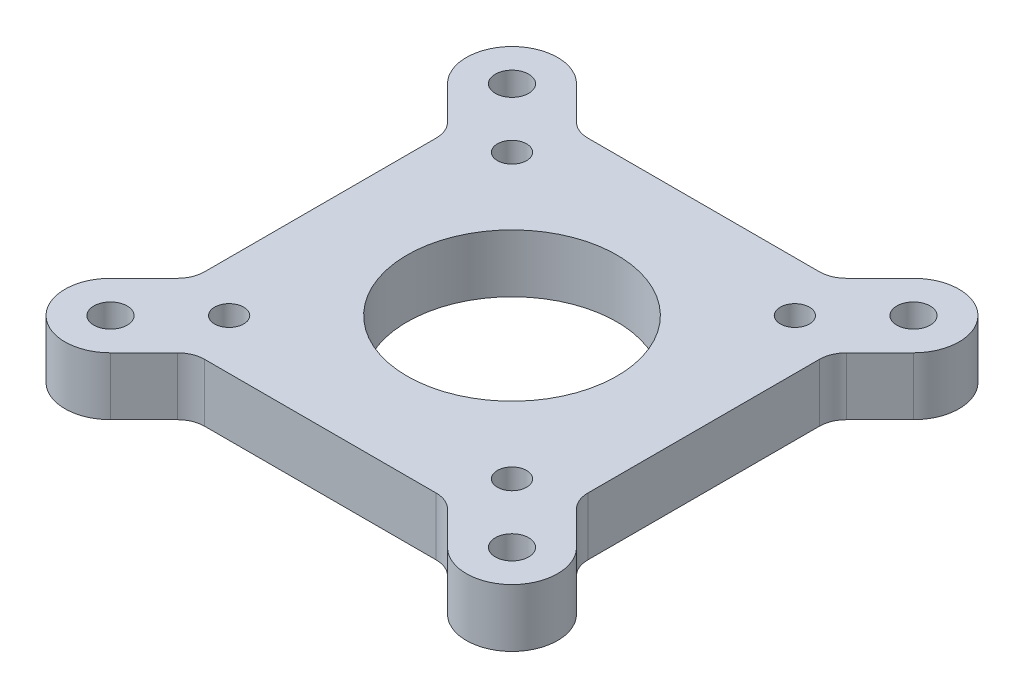
ISO-10303-21;
HEADER;
FILE_DESCRIPTION(('STEP AP214'),'2;1');
FILE_NAME('part.step','',(''),(''),'','','');
FILE_SCHEMA(('AUTOMOTIVE_DESIGN { 1 0 10303 214 1 1 1 1 }'));
ENDSEC;
DATA;
#1=APPLICATION_CONTEXT('core data for automotive mechanical design processes');
#2=APPLICATION_PROTOCOL_DEFINITION('international standard','automotive_design',2000,#1);
#3=PRODUCT_CONTEXT('',#1,'mechanical');
#4=PRODUCT('Part','Part','',(#3));
#5=PRODUCT_RELATED_PRODUCT_CATEGORY('part','',(#4));
#6=PRODUCT_DEFINITION_FORMATION('','',#4);
#7=PRODUCT_DEFINITION_CONTEXT('part definition',#1,'design');
#8=PRODUCT_DEFINITION('design','',#6,#7);
#9=PRODUCT_DEFINITION_SHAPE('','',#8);
#10=(LENGTH_UNIT() NAMED_UNIT(*) SI_UNIT(.MILLI.,.METRE.));
#11=(NAMED_UNIT(*) PLANE_ANGLE_UNIT() SI_UNIT($,.RADIAN.));
#12=(NAMED_UNIT(*) SI_UNIT($,.STERADIAN.) SOLID_ANGLE_UNIT());
#13=UNCERTAINTY_MEASURE_WITH_UNIT(LENGTH_MEASURE(1.E-05),#10,'distance_accuracy_value','');
#14=(GEOMETRIC_REPRESENTATION_CONTEXT(3) GLOBAL_UNCERTAINTY_ASSIGNED_CONTEXT((#13)) GLOBAL_UNIT_ASSIGNED_CONTEXT((#10,
#11,#12)) REPRESENTATION_CONTEXT('',''));
#15=CARTESIAN_POINT('',(0.,0.,0.));
#16=DIRECTION('',(0.,0.,1.));
#17=DIRECTION('',(1.,0.,0.));
#18=AXIS2_PLACEMENT_3D('',#15,#16,#17);
#19=CARTESIAN_POINT('',(-21.,6.35,-21.));
#20=DIRECTION('',(0.,0.,1.));
#21=DIRECTION('',(1.,0.,0.));
#22=AXIS2_PLACEMENT_3D('',#19,#20,#21);
#23=PLANE('',#22);
#24=DIRECTION('',(-1.,0.,0.));
#25=VECTOR('',#24,1.);
#26=CARTESIAN_POINT('',(-21.,6.35,-21.));
#27=LINE('',#26,#25);
#28=CARTESIAN_POINT('',(12.6862915010149,6.35,-21.));
#29=VERTEX_POINT('',#28);
#30=CARTESIAN_POINT('',(-12.6862915010152,6.35,-21.));
#31=VERTEX_POINT('',#30);
#32=EDGE_CURVE('E334',#29,#31,#27,.T.);
#33=ORIENTED_EDGE('',*,*,#32,.F.);
#34=DIRECTION('',(0.,1.,0.));
#35=VECTOR('',#34,1.);
#36=CARTESIAN_POINT('',(12.6862915010149,0.,-21.));
#37=LINE('',#36,#35);
#38=CARTESIAN_POINT('',(12.6862915010149,0.,-21.));
#39=VERTEX_POINT('',#38);
#40=EDGE_CURVE('E355',#29,#39,#37,.F.);
#41=ORIENTED_EDGE('',*,*,#40,.T.);
#42=DIRECTION('',(-1.,0.,0.));
#43=VECTOR('',#42,1.);
#44=CARTESIAN_POINT('',(-21.,0.,-21.));
#45=LINE('',#44,#43);
#46=CARTESIAN_POINT('',(-12.6862915010152,0.,-21.));
#47=VERTEX_POINT('',#46);
#48=EDGE_CURVE('E345',#39,#47,#45,.T.);
#49=ORIENTED_EDGE('',*,*,#48,.T.);
#50=DIRECTION('',(0.,1.,0.));
#51=VECTOR('',#50,1.);
#52=CARTESIAN_POINT('',(-12.6862915010152,6.35,-21.));
#53=LINE('',#52,#51);
#54=EDGE_CURVE('E352',#47,#31,#53,.T.);
#55=ORIENTED_EDGE('',*,*,#54,.T.);
#56=EDGE_LOOP('',(#33,#41,#49,#55));
#57=FACE_BOUND('',#56,.T.);
#58=ADVANCED_FACE('F34',(#57),#23,.F.);
#59=CARTESIAN_POINT('',(21.,6.35,21.));
#60=DIRECTION('',(-1.,0.,0.));
#61=DIRECTION('',(0.,0.,1.));
#62=AXIS2_PLACEMENT_3D('',#59,#60,#61);
#63=PLANE('',#62);
#64=DIRECTION('',(0.,0.,-1.));
#65=VECTOR('',#64,1.);
#66=CARTESIAN_POINT('',(21.,0.,21.));
#67=LINE('',#66,#65);
#68=CARTESIAN_POINT('',(21.,0.,12.6862915010152));
#69=VERTEX_POINT('',#68);
#70=CARTESIAN_POINT('',(21.,0.,-12.6862915010156));
#71=VERTEX_POINT('',#70);
#72=EDGE_CURVE('E342',#69,#71,#67,.T.);
#73=ORIENTED_EDGE('',*,*,#72,.T.);
#74=DIRECTION('',(0.,1.,0.));
#75=VECTOR('',#74,1.);
#76=CARTESIAN_POINT('',(21.,6.35,-12.6862915010156));
#77=LINE('',#76,#75);
#78=CARTESIAN_POINT('',(21.,6.35,-12.6862915010156));
#79=VERTEX_POINT('',#78);
#80=EDGE_CURVE('E359',#71,#79,#77,.T.);
#81=ORIENTED_EDGE('',*,*,#80,.T.);
#82=DIRECTION('',(0.,0.,-1.));
#83=VECTOR('',#82,1.);
#84=CARTESIAN_POINT('',(21.,6.35,21.));
#85=LINE('',#84,#83);
#86=CARTESIAN_POINT('',(21.,6.35,12.6862915010152));
#87=VERTEX_POINT('',#86);
#88=EDGE_CURVE('E330',#87,#79,#85,.T.);
#89=ORIENTED_EDGE('',*,*,#88,.F.);
#90=DIRECTION('',(0.,1.,0.));
#91=VECTOR('',#90,1.);
#92=CARTESIAN_POINT('',(21.,0.,12.6862915010152));
#93=LINE('',#92,#91);
#94=EDGE_CURVE('E357',#87,#69,#93,.F.);
#95=ORIENTED_EDGE('',*,*,#94,.T.);
#96=EDGE_LOOP('',(#73,#81,#89,#95));
#97=FACE_BOUND('',#96,.T.);
#98=ADVANCED_FACE('F484',(#97),#63,.F.);
#99=CARTESIAN_POINT('',(-21.,6.35,21.));
#100=DIRECTION('',(0.,0.,-1.));
#101=DIRECTION('',(-1.,0.,0.));
#102=AXIS2_PLACEMENT_3D('',#99,#100,#101);
#103=PLANE('',#102);
#104=DIRECTION('',(1.,0.,0.));
#105=VECTOR('',#104,1.);
#106=CARTESIAN_POINT('',(-21.,0.,21.));
#107=LINE('',#106,#105);
#108=CARTESIAN_POINT('',(-12.6862915010151,0.,21.));
#109=VERTEX_POINT('',#108);
#110=CARTESIAN_POINT('',(12.6862915010152,0.,21.));
#111=VERTEX_POINT('',#110);
#112=EDGE_CURVE('E326',#109,#111,#107,.T.);
#113=ORIENTED_EDGE('',*,*,#112,.T.);
#114=DIRECTION('',(0.,1.,0.));
#115=VECTOR('',#114,1.);
#116=CARTESIAN_POINT('',(12.6862915010152,6.35,21.));
#117=LINE('',#116,#115);
#118=CARTESIAN_POINT('',(12.6862915010152,6.35,21.));
#119=VERTEX_POINT('',#118);
#120=EDGE_CURVE('E368',#111,#119,#117,.T.);
#121=ORIENTED_EDGE('',*,*,#120,.T.);
#122=DIRECTION('',(1.,0.,0.));
#123=VECTOR('',#122,1.);
#124=CARTESIAN_POINT('',(-21.,6.35,21.));
#125=LINE('',#124,#123);
#126=CARTESIAN_POINT('',(-12.6862915010151,6.35,21.));
#127=VERTEX_POINT('',#126);
#128=EDGE_CURVE('E327',#127,#119,#125,.T.);
#129=ORIENTED_EDGE('',*,*,#128,.F.);
#130=DIRECTION('',(0.,1.,0.));
#131=VECTOR('',#130,1.);
#132=CARTESIAN_POINT('',(-12.6862915010151,0.,21.));
#133=LINE('',#132,#131);
#134=EDGE_CURVE('E366',#127,#109,#133,.F.);
#135=ORIENTED_EDGE('',*,*,#134,.T.);
#136=EDGE_LOOP('',(#113,#121,#129,#135));
#137=FACE_BOUND('',#136,.T.);
#138=ADVANCED_FACE('F456',(#137),#103,.F.);
#139=CARTESIAN_POINT('',(-21.,6.35,21.));
#140=DIRECTION('',(1.,0.,0.));
#141=DIRECTION('',(0.,0.,-1.));
#142=AXIS2_PLACEMENT_3D('',#139,#140,#141);
#143=PLANE('',#142);
#144=DIRECTION('',(0.,0.,1.));
#145=VECTOR('',#144,1.);
#146=CARTESIAN_POINT('',(-21.,0.,21.));
#147=LINE('',#146,#145);
#148=CARTESIAN_POINT('',(-21.,0.,-12.6862915010152));
#149=VERTEX_POINT('',#148);
#150=CARTESIAN_POINT('',(-21.,0.,12.6862915010154));
#151=VERTEX_POINT('',#150);
#152=EDGE_CURVE('E331',#149,#151,#147,.T.);
#153=ORIENTED_EDGE('',*,*,#152,.T.);
#154=DIRECTION('',(0.,1.,0.));
#155=VECTOR('',#154,1.);
#156=CARTESIAN_POINT('',(-21.,6.35,12.6862915010154));
#157=LINE('',#156,#155);
#158=CARTESIAN_POINT('',(-21.,6.35,12.6862915010154));
#159=VERTEX_POINT('',#158);
#160=EDGE_CURVE('E378',#151,#159,#157,.T.);
#161=ORIENTED_EDGE('',*,*,#160,.T.);
#162=DIRECTION('',(0.,0.,1.));
#163=VECTOR('',#162,1.);
#164=CARTESIAN_POINT('',(-21.,6.35,21.));
#165=LINE('',#164,#163);
#166=CARTESIAN_POINT('',(-21.,6.35,-12.6862915010152));
#167=VERTEX_POINT('',#166);
#168=EDGE_CURVE('E336',#167,#159,#165,.T.);
#169=ORIENTED_EDGE('',*,*,#168,.F.);
#170=DIRECTION('',(0.,1.,0.));
#171=VECTOR('',#170,1.);
#172=CARTESIAN_POINT('',(-21.,0.,-12.6862915010152));
#173=LINE('',#172,#171);
#174=EDGE_CURVE('E376',#167,#149,#173,.F.);
#175=ORIENTED_EDGE('',*,*,#174,.T.);
#176=EDGE_LOOP('',(#153,#161,#169,#175));
#177=FACE_BOUND('',#176,.T.);
#178=ADVANCED_FACE('F429',(#177),#143,.F.);
#179=CARTESIAN_POINT('',(0.,6.35,0.));
#180=DIRECTION('',(0.,1.,0.));
#181=DIRECTION('',(0.,0.,1.));
#182=AXIS2_PLACEMENT_3D('',#179,#180,#181);
#183=PLANE('',#182);
#184=CARTESIAN_POINT('',(21.9999999999998,6.35,-22.0000000000002));
#185=DIRECTION('',(0.,1.,0.));
#186=DIRECTION('',(0.,0.,1.));
#187=AXIS2_PLACEMENT_3D('',#184,#185,#186);
#188=CIRCLE('',#187,1.8288);
#189=CARTESIAN_POINT('',(21.9999999999998,6.35,-20.1712000000002));
#190=VERTEX_POINT('',#189);
#191=EDGE_CURVE('E850',#190,#190,#188,.T.);
#192=ORIENTED_EDGE('',*,*,#191,.F.);
#193=EDGE_LOOP('',(#192));
#194=FACE_BOUND('',#193,.T.);
#195=CARTESIAN_POINT('',(22.,6.35,22.));
#196=DIRECTION('',(0.,1.,0.));
#197=DIRECTION('',(0.,0.,1.));
#198=AXIS2_PLACEMENT_3D('',#195,#196,#197);
#199=CIRCLE('',#198,1.8288);
#200=CARTESIAN_POINT('',(22.,6.35,23.8288));
#201=VERTEX_POINT('',#200);
#202=EDGE_CURVE('E854',#201,#201,#199,.T.);
#203=ORIENTED_EDGE('',*,*,#202,.F.);
#204=EDGE_LOOP('',(#203));
#205=FACE_BOUND('',#204,.T.);
#206=CARTESIAN_POINT('',(-21.9999999999999,6.35,22.0000000000001));
#207=DIRECTION('',(0.,1.,0.));
#208=DIRECTION('',(0.,0.,1.));
#209=AXIS2_PLACEMENT_3D('',#206,#207,#208);
#210=CIRCLE('',#209,1.8288);
#211=CARTESIAN_POINT('',(-21.9999999999999,6.35,23.8288000000001));
#212=VERTEX_POINT('',#211);
#213=EDGE_CURVE('E857',#212,#212,#210,.T.);
#214=ORIENTED_EDGE('',*,*,#213,.F.);
#215=EDGE_LOOP('',(#214));
#216=FACE_BOUND('',#215,.T.);
#217=CARTESIAN_POINT('',(-22.,6.35,-22.));
#218=DIRECTION('',(0.,1.,0.));
#219=DIRECTION('',(0.,0.,1.));
#220=AXIS2_PLACEMENT_3D('',#217,#218,#219);
#221=CIRCLE('',#220,1.8288);
#222=CARTESIAN_POINT('',(-22.,6.35,-20.1712));
#223=VERTEX_POINT('',#222);
#224=EDGE_CURVE('E268',#223,#223,#221,.T.);
#225=ORIENTED_EDGE('',*,*,#224,.F.);
#226=EDGE_LOOP('',(#225));
#227=FACE_BOUND('',#226,.T.);
#228=CARTESIAN_POINT('',(0.,6.35,0.));
#229=DIRECTION('',(0.,1.,0.));
#230=DIRECTION('',(0.,0.,1.));
#231=AXIS2_PLACEMENT_3D('',#228,#229,#230);
#232=CIRCLE('',#231,11.5);
#233=CARTESIAN_POINT('',(0.,6.35,11.5));
#234=VERTEX_POINT('',#233);
#235=EDGE_CURVE('E294',#234,#234,#232,.T.);
#236=ORIENTED_EDGE('',*,*,#235,.F.);
#237=EDGE_LOOP('',(#236));
#238=FACE_BOUND('',#237,.T.);
#239=CARTESIAN_POINT('',(-15.5,6.35,-15.5));
#240=DIRECTION('',(0.,1.,0.));
#241=DIRECTION('',(0.,0.,1.));
#242=AXIS2_PLACEMENT_3D('',#239,#240,#241);
#243=CIRCLE('',#242,1.59999999999999);
#244=CARTESIAN_POINT('',(-15.5,6.35,-13.9));
#245=VERTEX_POINT('',#244);
#246=EDGE_CURVE('E300',#245,#245,#243,.T.);
#247=ORIENTED_EDGE('',*,*,#246,.F.);
#248=EDGE_LOOP('',(#247));
#249=FACE_BOUND('',#248,.T.);
#250=CARTESIAN_POINT('',(-15.5,6.35,15.5));
#251=DIRECTION('',(0.,1.,0.));
#252=DIRECTION('',(0.,0.,1.));
#253=AXIS2_PLACEMENT_3D('',#250,#251,#252);
#254=CIRCLE('',#253,1.59999999999999);
#255=CARTESIAN_POINT('',(-15.5,6.35,17.1));
#256=VERTEX_POINT('',#255);
#257=EDGE_CURVE('E308',#256,#256,#254,.T.);
#258=ORIENTED_EDGE('',*,*,#257,.F.);
#259=EDGE_LOOP('',(#258));
#260=FACE_BOUND('',#259,.T.);
#261=CARTESIAN_POINT('',(15.5,6.35,15.5));
#262=DIRECTION('',(0.,1.,0.));
#263=DIRECTION('',(0.,0.,1.));
#264=AXIS2_PLACEMENT_3D('',#261,#262,#263);
#265=CIRCLE('',#264,1.59999999999999);
#266=CARTESIAN_POINT('',(15.5,6.35,17.1));
#267=VERTEX_POINT('',#266);
#268=EDGE_CURVE('E314',#267,#267,#265,.T.);
#269=ORIENTED_EDGE('',*,*,#268,.F.);
#270=EDGE_LOOP('',(#269));
#271=FACE_BOUND('',#270,.T.);
#272=CARTESIAN_POINT('',(15.5,6.35,-15.5));
#273=DIRECTION('',(0.,1.,0.));
#274=DIRECTION('',(0.,0.,1.));
#275=AXIS2_PLACEMENT_3D('',#272,#273,#274);
#276=CIRCLE('',#275,1.59999999999999);
#277=CARTESIAN_POINT('',(15.5,6.35,-13.9));
#278=VERTEX_POINT('',#277);
#279=EDGE_CURVE('E320',#278,#278,#276,.T.);
#280=ORIENTED_EDGE('',*,*,#279,.F.);
#281=EDGE_LOOP('',(#280));
#282=FACE_BOUND('',#281,.T.);
#283=DIRECTION('',(-0.707106781186548,0.,-0.707106781186548));
#284=VECTOR('',#283,1.);
#285=CARTESIAN_POINT('',(-3.53553390593274,6.35,3.53553390593274));
#286=LINE('',#285,#284);
#287=CARTESIAN_POINT('',(-21.8786796564404,6.35,-14.8076118445749));
#288=VERTEX_POINT('',#287);
#289=CARTESIAN_POINT('',(-25.5355339059327,6.35,-18.4644660940673));
#290=VERTEX_POINT('',#289);
#291=EDGE_CURVE('E280',#288,#290,#286,.T.);
#292=ORIENTED_EDGE('',*,*,#291,.F.);
#293=CARTESIAN_POINT('',(-24.,6.35,-12.6862915010152));
#294=DIRECTION('',(0.,1.,0.));
#295=DIRECTION('',(0.,0.,1.));
#296=AXIS2_PLACEMENT_3D('',#293,#294,#295);
#297=CIRCLE('',#296,3.);
#298=EDGE_CURVE('E411',#288,#167,#297,.F.);
#299=ORIENTED_EDGE('',*,*,#298,.T.);
#300=ORIENTED_EDGE('',*,*,#168,.T.);
#301=CARTESIAN_POINT('',(-24.,6.35,12.6862915010154));
#302=DIRECTION('',(0.,1.,0.));
#303=DIRECTION('',(0.,0.,1.));
#304=AXIS2_PLACEMENT_3D('',#301,#302,#303);
#305=CIRCLE('',#304,3.);
#306=CARTESIAN_POINT('',(-21.8786796564403,6.35,14.807611844575));
#307=VERTEX_POINT('',#306);
#308=EDGE_CURVE('E407',#159,#307,#305,.F.);
#309=ORIENTED_EDGE('',*,*,#308,.T.);
#310=DIRECTION('',(-0.707106781186545,0.,0.70710678118655));
#311=VECTOR('',#310,1.);
#312=CARTESIAN_POINT('',(-3.53553390593276,6.35,-3.53553390593273));
#313=LINE('',#312,#311);
#314=CARTESIAN_POINT('',(-25.5355339059327,6.35,18.4644660940674));
#315=VERTEX_POINT('',#314);
#316=EDGE_CURVE('E248',#307,#315,#313,.T.);
#317=ORIENTED_EDGE('',*,*,#316,.T.);
#318=CARTESIAN_POINT('',(-21.9999999999999,6.35,22.0000000000001));
#319=DIRECTION('',(0.,1.,0.));
#320=DIRECTION('',(1.,0.,0.));
#321=AXIS2_PLACEMENT_3D('',#318,#319,#320);
#322=CIRCLE('',#321,5.);
#323=CARTESIAN_POINT('',(-18.4644660940672,6.35,25.5355339059328));
#324=VERTEX_POINT('',#323);
#325=EDGE_CURVE('E261',#315,#324,#322,.T.);
#326=ORIENTED_EDGE('',*,*,#325,.T.);
#327=DIRECTION('',(-0.707106781186545,0.,0.70710678118655));
#328=VECTOR('',#327,1.);
#329=CARTESIAN_POINT('',(3.53553390593275,6.35,3.53553390593272));
#330=LINE('',#329,#328);
#331=CARTESIAN_POINT('',(-14.8076118445748,6.35,21.8786796564404));
#332=VERTEX_POINT('',#331);
#333=EDGE_CURVE('E254',#332,#324,#330,.T.);
#334=ORIENTED_EDGE('',*,*,#333,.F.);
#335=CARTESIAN_POINT('',(-12.6862915010151,6.35,24.));
#336=DIRECTION('',(0.,1.,0.));
#337=DIRECTION('',(0.,0.,1.));
#338=AXIS2_PLACEMENT_3D('',#335,#336,#337);
#339=CIRCLE('',#338,3.);
#340=EDGE_CURVE('E403',#332,#127,#339,.F.);
#341=ORIENTED_EDGE('',*,*,#340,.T.);
#342=ORIENTED_EDGE('',*,*,#128,.T.);
#343=CARTESIAN_POINT('',(12.6862915010152,6.35,24.));
#344=DIRECTION('',(0.,1.,0.));
#345=DIRECTION('',(0.,0.,1.));
#346=AXIS2_PLACEMENT_3D('',#343,#344,#345);
#347=CIRCLE('',#346,3.);
#348=CARTESIAN_POINT('',(14.8076118445749,6.35,21.8786796564404));
#349=VERTEX_POINT('',#348);
#350=EDGE_CURVE('E399',#119,#349,#347,.F.);
#351=ORIENTED_EDGE('',*,*,#350,.T.);
#352=DIRECTION('',(0.707106781186548,0.,0.707106781186547));
#353=VECTOR('',#352,1.);
#354=CARTESIAN_POINT('',(-3.53553390593274,6.35,3.53553390593275));
#355=LINE('',#354,#353);
#356=CARTESIAN_POINT('',(18.4644660940673,6.35,25.5355339059327));
#357=VERTEX_POINT('',#356);
#358=EDGE_CURVE('E229',#349,#357,#355,.T.);
#359=ORIENTED_EDGE('',*,*,#358,.T.);
#360=CARTESIAN_POINT('',(22.,6.35,22.));
#361=DIRECTION('',(0.,1.,0.));
#362=DIRECTION('',(0.,0.,-1.));
#363=AXIS2_PLACEMENT_3D('',#360,#361,#362);
#364=CIRCLE('',#363,5.);
#365=CARTESIAN_POINT('',(25.5355339059327,6.35,18.4644660940673));
#366=VERTEX_POINT('',#365);
#367=EDGE_CURVE('E241',#357,#366,#364,.T.);
#368=ORIENTED_EDGE('',*,*,#367,.T.);
#369=DIRECTION('',(0.707106781186548,0.,0.707106781186548));
#370=VECTOR('',#369,1.);
#371=CARTESIAN_POINT('',(3.53553390593274,6.35,-3.53553390593274));
#372=LINE('',#371,#370);
#373=CARTESIAN_POINT('',(21.8786796564404,6.35,14.8076118445749));
#374=VERTEX_POINT('',#373);
#375=EDGE_CURVE('E234',#374,#366,#372,.T.);
#376=ORIENTED_EDGE('',*,*,#375,.F.);
#377=CARTESIAN_POINT('',(24.,6.35,12.6862915010152));
#378=DIRECTION('',(0.,1.,0.));
#379=DIRECTION('',(0.,0.,1.));
#380=AXIS2_PLACEMENT_3D('',#377,#378,#379);
#381=CIRCLE('',#380,3.);
#382=EDGE_CURVE('E395',#374,#87,#381,.F.);
#383=ORIENTED_EDGE('',*,*,#382,.T.);
#384=ORIENTED_EDGE('',*,*,#88,.T.);
#385=CARTESIAN_POINT('',(24.,6.35,-12.6862915010156));
#386=DIRECTION('',(0.,1.,0.));
#387=DIRECTION('',(0.,0.,1.));
#388=AXIS2_PLACEMENT_3D('',#385,#386,#387);
#389=CIRCLE('',#388,3.);
#390=CARTESIAN_POINT('',(21.8786796564403,6.35,-14.8076118445752));
#391=VERTEX_POINT('',#390);
#392=EDGE_CURVE('E391',#79,#391,#389,.F.);
#393=ORIENTED_EDGE('',*,*,#392,.T.);
#394=DIRECTION('',(0.70710678118654,0.,-0.707106781186555));
#395=VECTOR('',#394,1.);
#396=CARTESIAN_POINT('',(3.53553390593278,6.35,3.53553390593271));
#397=LINE('',#396,#395);
#398=CARTESIAN_POINT('',(25.5355339059325,6.35,-18.4644660940675));
#399=VERTEX_POINT('',#398);
#400=EDGE_CURVE('E224',#391,#399,#397,.T.);
#401=ORIENTED_EDGE('',*,*,#400,.T.);
#402=CARTESIAN_POINT('',(21.9999999999998,6.35,-22.0000000000002));
#403=DIRECTION('',(0.,1.,0.));
#404=DIRECTION('',(-1.,0.,0.));
#405=AXIS2_PLACEMENT_3D('',#402,#403,#404);
#406=CIRCLE('',#405,5.);
#407=CARTESIAN_POINT('',(18.464466094067,6.35,-25.5355339059329));
#408=VERTEX_POINT('',#407);
#409=EDGE_CURVE('E212',#399,#408,#406,.T.);
#410=ORIENTED_EDGE('',*,*,#409,.T.);
#411=DIRECTION('',(0.70710678118654,0.,-0.707106781186555));
#412=VECTOR('',#411,1.);
#413=CARTESIAN_POINT('',(-3.53553390593277,6.35,-3.5355339059327));
#414=LINE('',#413,#412);
#415=CARTESIAN_POINT('',(14.8076118445745,6.35,-21.8786796564404));
#416=VERTEX_POINT('',#415);
#417=EDGE_CURVE('E205',#416,#408,#414,.T.);
#418=ORIENTED_EDGE('',*,*,#417,.F.);
#419=CARTESIAN_POINT('',(12.6862915010149,6.35,-24.));
#420=DIRECTION('',(0.,1.,0.));
#421=DIRECTION('',(0.,0.,1.));
#422=AXIS2_PLACEMENT_3D('',#419,#420,#421);
#423=CIRCLE('',#422,3.);
#424=EDGE_CURVE('E387',#416,#29,#423,.F.);
#425=ORIENTED_EDGE('',*,*,#424,.T.);
#426=ORIENTED_EDGE('',*,*,#32,.T.);
#427=CARTESIAN_POINT('',(-12.6862915010152,6.35,-24.));
#428=DIRECTION('',(0.,1.,0.));
#429=DIRECTION('',(0.,0.,1.));
#430=AXIS2_PLACEMENT_3D('',#427,#428,#429);
#431=CIRCLE('',#430,3.);
#432=CARTESIAN_POINT('',(-14.8076118445749,6.35,-21.8786796564404));
#433=VERTEX_POINT('',#432);
#434=EDGE_CURVE('E42',#31,#433,#431,.F.);
#435=ORIENTED_EDGE('',*,*,#434,.T.);
#436=DIRECTION('',(-0.707106781186548,0.,-0.707106781186547));
#437=VECTOR('',#436,1.);
#438=CARTESIAN_POINT('',(3.53553390593274,6.35,-3.53553390593275));
#439=LINE('',#438,#437);
#440=CARTESIAN_POINT('',(-18.4644660940673,6.35,-25.5355339059327));
#441=VERTEX_POINT('',#440);
#442=EDGE_CURVE('E276',#433,#441,#439,.T.);
#443=ORIENTED_EDGE('',*,*,#442,.T.);
#444=CARTESIAN_POINT('',(-22.,6.35,-22.));
#445=DIRECTION('',(0.,1.,0.));
#446=DIRECTION('',(0.,0.,1.));
#447=AXIS2_PLACEMENT_3D('',#444,#445,#446);
#448=CIRCLE('',#447,5.);
#449=EDGE_CURVE('E287',#441,#290,#448,.T.);
#450=ORIENTED_EDGE('',*,*,#449,.T.);
#451=EDGE_LOOP('',(#292,#299,#300,#309,#317,#326,#334,#341,#342,#351,#359,#368,#376,#383,#384,
#393,#401,#410,#418,#425,#426,#435,#443,#450));
#452=FACE_BOUND('',#451,.T.);
#453=ADVANCED_FACE('F427',(#194,#205,#216,#227,#238,#249,#260,#271,#282,#452),#183,.T.);
#454=CARTESIAN_POINT('',(0.,0.,0.));
#455=DIRECTION('',(0.,1.,0.));
#456=DIRECTION('',(0.,0.,1.));
#457=AXIS2_PLACEMENT_3D('',#454,#455,#456);
#458=PLANE('',#457);
#459=CARTESIAN_POINT('',(21.9999999999998,0.,-22.0000000000002));
#460=DIRECTION('',(0.,1.,0.));
#461=DIRECTION('',(0.,0.,1.));
#462=AXIS2_PLACEMENT_3D('',#459,#460,#461);
#463=CIRCLE('',#462,1.8288);
#464=CARTESIAN_POINT('',(21.9999999999998,0.,-20.1712000000002));
#465=VERTEX_POINT('',#464);
#466=EDGE_CURVE('E866',#465,#465,#463,.T.);
#467=ORIENTED_EDGE('',*,*,#466,.T.);
#468=EDGE_LOOP('',(#467));
#469=FACE_BOUND('',#468,.T.);
#470=CARTESIAN_POINT('',(22.,0.,22.));
#471=DIRECTION('',(0.,1.,0.));
#472=DIRECTION('',(0.,0.,1.));
#473=AXIS2_PLACEMENT_3D('',#470,#471,#472);
#474=CIRCLE('',#473,1.8288);
#475=CARTESIAN_POINT('',(22.,0.,23.8288));
#476=VERTEX_POINT('',#475);
#477=EDGE_CURVE('E859',#476,#476,#474,.T.);
#478=ORIENTED_EDGE('',*,*,#477,.T.);
#479=EDGE_LOOP('',(#478));
#480=FACE_BOUND('',#479,.T.);
#481=CARTESIAN_POINT('',(-21.9999999999999,0.,22.0000000000001));
#482=DIRECTION('',(0.,1.,0.));
#483=DIRECTION('',(0.,0.,1.));
#484=AXIS2_PLACEMENT_3D('',#481,#482,#483);
#485=CIRCLE('',#484,1.8288);
#486=CARTESIAN_POINT('',(-21.9999999999999,0.,23.8288000000001));
#487=VERTEX_POINT('',#486);
#488=EDGE_CURVE('E226',#487,#487,#485,.T.);
#489=ORIENTED_EDGE('',*,*,#488,.T.);
#490=EDGE_LOOP('',(#489));
#491=FACE_BOUND('',#490,.T.);
#492=CARTESIAN_POINT('',(-22.,0.,-22.));
#493=DIRECTION('',(0.,1.,0.));
#494=DIRECTION('',(0.,0.,1.));
#495=AXIS2_PLACEMENT_3D('',#492,#493,#494);
#496=CIRCLE('',#495,1.8288);
#497=CARTESIAN_POINT('',(-22.,0.,-20.1712));
#498=VERTEX_POINT('',#497);
#499=EDGE_CURVE('E273',#498,#498,#496,.T.);
#500=ORIENTED_EDGE('',*,*,#499,.T.);
#501=EDGE_LOOP('',(#500));
#502=FACE_BOUND('',#501,.T.);
#503=CARTESIAN_POINT('',(0.,0.,0.));
#504=DIRECTION('',(0.,1.,0.));
#505=DIRECTION('',(0.,0.,1.));
#506=AXIS2_PLACEMENT_3D('',#503,#504,#505);
#507=CIRCLE('',#506,11.5);
#508=CARTESIAN_POINT('',(0.,0.,11.5));
#509=VERTEX_POINT('',#508);
#510=EDGE_CURVE('E297',#509,#509,#507,.T.);
#511=ORIENTED_EDGE('',*,*,#510,.T.);
#512=EDGE_LOOP('',(#511));
#513=FACE_BOUND('',#512,.T.);
#514=CARTESIAN_POINT('',(-15.5,0.,-15.5));
#515=DIRECTION('',(0.,1.,0.));
#516=DIRECTION('',(0.,0.,1.));
#517=AXIS2_PLACEMENT_3D('',#514,#515,#516);
#518=CIRCLE('',#517,1.6);
#519=CARTESIAN_POINT('',(-15.5,0.,-13.9));
#520=VERTEX_POINT('',#519);
#521=EDGE_CURVE('E305',#520,#520,#518,.T.);
#522=ORIENTED_EDGE('',*,*,#521,.T.);
#523=EDGE_LOOP('',(#522));
#524=FACE_BOUND('',#523,.T.);
#525=CARTESIAN_POINT('',(-15.5,0.,15.5));
#526=DIRECTION('',(0.,1.,0.));
#527=DIRECTION('',(0.,0.,1.));
#528=AXIS2_PLACEMENT_3D('',#525,#526,#527);
#529=CIRCLE('',#528,1.6);
#530=CARTESIAN_POINT('',(-15.5,0.,17.1));
#531=VERTEX_POINT('',#530);
#532=EDGE_CURVE('E311',#531,#531,#529,.T.);
#533=ORIENTED_EDGE('',*,*,#532,.T.);
#534=EDGE_LOOP('',(#533));
#535=FACE_BOUND('',#534,.T.);
#536=CARTESIAN_POINT('',(15.5,0.,15.5));
#537=DIRECTION('',(0.,1.,0.));
#538=DIRECTION('',(0.,0.,1.));
#539=AXIS2_PLACEMENT_3D('',#536,#537,#538);
#540=CIRCLE('',#539,1.6);
#541=CARTESIAN_POINT('',(15.5,0.,17.1));
#542=VERTEX_POINT('',#541);
#543=EDGE_CURVE('E317',#542,#542,#540,.T.);
#544=ORIENTED_EDGE('',*,*,#543,.T.);
#545=EDGE_LOOP('',(#544));
#546=FACE_BOUND('',#545,.T.);
#547=CARTESIAN_POINT('',(15.5,0.,-15.5));
#548=DIRECTION('',(0.,1.,0.));
#549=DIRECTION('',(0.,0.,1.));
#550=AXIS2_PLACEMENT_3D('',#547,#548,#549);
#551=CIRCLE('',#550,1.6);
#552=CARTESIAN_POINT('',(15.5,0.,-13.9));
#553=VERTEX_POINT('',#552);
#554=EDGE_CURVE('E323',#553,#553,#551,.T.);
#555=ORIENTED_EDGE('',*,*,#554,.T.);
#556=EDGE_LOOP('',(#555));
#557=FACE_BOUND('',#556,.T.);
#558=ORIENTED_EDGE('',*,*,#112,.F.);
#559=CARTESIAN_POINT('',(-12.6862915010151,0.,24.));
#560=DIRECTION('',(0.,1.,0.));
#561=DIRECTION('',(0.,0.,1.));
#562=AXIS2_PLACEMENT_3D('',#559,#560,#561);
#563=CIRCLE('',#562,3.);
#564=CARTESIAN_POINT('',(-14.8076118445748,0.,21.8786796564404));
#565=VERTEX_POINT('',#564);
#566=EDGE_CURVE('E405',#109,#565,#563,.T.);
#567=ORIENTED_EDGE('',*,*,#566,.T.);
#568=DIRECTION('',(-0.707106781186545,0.,0.70710678118655));
#569=VECTOR('',#568,1.);
#570=CARTESIAN_POINT('',(3.53553390593275,0.,3.53553390593272));
#571=LINE('',#570,#569);
#572=CARTESIAN_POINT('',(-18.4644660940672,0.,25.5355339059328));
#573=VERTEX_POINT('',#572);
#574=EDGE_CURVE('E257',#565,#573,#571,.T.);
#575=ORIENTED_EDGE('',*,*,#574,.T.);
#576=CARTESIAN_POINT('',(-21.9999999999999,0.,22.0000000000001));
#577=DIRECTION('',(0.,1.,0.));
#578=DIRECTION('',(1.,0.,0.));
#579=AXIS2_PLACEMENT_3D('',#576,#577,#578);
#580=CIRCLE('',#579,5.);
#581=CARTESIAN_POINT('',(-25.5355339059327,0.,18.4644660940674));
#582=VERTEX_POINT('',#581);
#583=EDGE_CURVE('E253',#582,#573,#580,.T.);
#584=ORIENTED_EDGE('',*,*,#583,.F.);
#585=DIRECTION('',(-0.707106781186545,0.,0.70710678118655));
#586=VECTOR('',#585,1.);
#587=CARTESIAN_POINT('',(-3.53553390593276,0.,-3.53553390593273));
#588=LINE('',#587,#586);
#589=CARTESIAN_POINT('',(-21.8786796564403,0.,14.807611844575));
#590=VERTEX_POINT('',#589);
#591=EDGE_CURVE('E251',#590,#582,#588,.T.);
#592=ORIENTED_EDGE('',*,*,#591,.F.);
#593=CARTESIAN_POINT('',(-24.,0.,12.6862915010154));
#594=DIRECTION('',(0.,1.,0.));
#595=DIRECTION('',(0.,0.,1.));
#596=AXIS2_PLACEMENT_3D('',#593,#594,#595);
#597=CIRCLE('',#596,3.);
#598=EDGE_CURVE('E409',#590,#151,#597,.T.);
#599=ORIENTED_EDGE('',*,*,#598,.T.);
#600=ORIENTED_EDGE('',*,*,#152,.F.);
#601=CARTESIAN_POINT('',(-24.,0.,-12.6862915010152));
#602=DIRECTION('',(0.,1.,0.));
#603=DIRECTION('',(0.,0.,1.));
#604=AXIS2_PLACEMENT_3D('',#601,#602,#603);
#605=CIRCLE('',#604,3.);
#606=CARTESIAN_POINT('',(-21.8786796564404,0.,-14.8076118445749));
#607=VERTEX_POINT('',#606);
#608=EDGE_CURVE('E413',#149,#607,#605,.T.);
#609=ORIENTED_EDGE('',*,*,#608,.T.);
#610=DIRECTION('',(-0.707106781186548,0.,-0.707106781186548));
#611=VECTOR('',#610,1.);
#612=CARTESIAN_POINT('',(-3.53553390593274,0.,3.53553390593274));
#613=LINE('',#612,#611);
#614=CARTESIAN_POINT('',(-25.5355339059327,0.,-18.4644660940673));
#615=VERTEX_POINT('',#614);
#616=EDGE_CURVE('E283',#607,#615,#613,.T.);
#617=ORIENTED_EDGE('',*,*,#616,.T.);
#618=CARTESIAN_POINT('',(-22.,0.,-22.));
#619=DIRECTION('',(0.,1.,0.));
#620=DIRECTION('',(0.,0.,1.));
#621=AXIS2_PLACEMENT_3D('',#618,#619,#620);
#622=CIRCLE('',#621,5.);
#623=CARTESIAN_POINT('',(-18.4644660940673,0.,-25.5355339059327));
#624=VERTEX_POINT('',#623);
#625=EDGE_CURVE('E279',#624,#615,#622,.T.);
#626=ORIENTED_EDGE('',*,*,#625,.F.);
#627=DIRECTION('',(-0.707106781186548,0.,-0.707106781186547));
#628=VECTOR('',#627,1.);
#629=CARTESIAN_POINT('',(3.53553390593274,0.,-3.53553390593275));
#630=LINE('',#629,#628);
#631=CARTESIAN_POINT('',(-14.8076118445749,0.,-21.8786796564404));
#632=VERTEX_POINT('',#631);
#633=EDGE_CURVE('E277',#632,#624,#630,.T.);
#634=ORIENTED_EDGE('',*,*,#633,.F.);
#635=CARTESIAN_POINT('',(-12.6862915010152,0.,-24.));
#636=DIRECTION('',(0.,1.,0.));
#637=DIRECTION('',(0.,0.,1.));
#638=AXIS2_PLACEMENT_3D('',#635,#636,#637);
#639=CIRCLE('',#638,3.);
#640=EDGE_CURVE('E11',#632,#47,#639,.T.);
#641=ORIENTED_EDGE('',*,*,#640,.T.);
#642=ORIENTED_EDGE('',*,*,#48,.F.);
#643=CARTESIAN_POINT('',(12.6862915010149,0.,-24.));
#644=DIRECTION('',(0.,1.,0.));
#645=DIRECTION('',(0.,0.,1.));
#646=AXIS2_PLACEMENT_3D('',#643,#644,#645);
#647=CIRCLE('',#646,3.);
#648=CARTESIAN_POINT('',(14.8076118445745,0.,-21.8786796564404));
#649=VERTEX_POINT('',#648);
#650=EDGE_CURVE('E389',#39,#649,#647,.T.);
#651=ORIENTED_EDGE('',*,*,#650,.T.);
#652=DIRECTION('',(0.70710678118654,0.,-0.707106781186555));
#653=VECTOR('',#652,1.);
#654=CARTESIAN_POINT('',(-3.53553390593277,0.,-3.5355339059327));
#655=LINE('',#654,#653);
#656=CARTESIAN_POINT('',(18.464466094067,0.,-25.5355339059329));
#657=VERTEX_POINT('',#656);
#658=EDGE_CURVE('E214',#649,#657,#655,.T.);
#659=ORIENTED_EDGE('',*,*,#658,.T.);
#660=CARTESIAN_POINT('',(21.9999999999998,0.,-22.0000000000002));
#661=DIRECTION('',(0.,1.,0.));
#662=DIRECTION('',(-1.,0.,0.));
#663=AXIS2_PLACEMENT_3D('',#660,#661,#662);
#664=CIRCLE('',#663,5.);
#665=CARTESIAN_POINT('',(25.5355339059325,0.,-18.4644660940675));
#666=VERTEX_POINT('',#665);
#667=EDGE_CURVE('E204',#666,#657,#664,.T.);
#668=ORIENTED_EDGE('',*,*,#667,.F.);
#669=DIRECTION('',(0.70710678118654,0.,-0.707106781186555));
#670=VECTOR('',#669,1.);
#671=CARTESIAN_POINT('',(3.53553390593278,0.,3.53553390593271));
#672=LINE('',#671,#670);
#673=CARTESIAN_POINT('',(21.8786796564403,0.,-14.8076118445752));
#674=VERTEX_POINT('',#673);
#675=EDGE_CURVE('E193',#674,#666,#672,.T.);
#676=ORIENTED_EDGE('',*,*,#675,.F.);
#677=CARTESIAN_POINT('',(24.,0.,-12.6862915010156));
#678=DIRECTION('',(0.,1.,0.));
#679=DIRECTION('',(0.,0.,1.));
#680=AXIS2_PLACEMENT_3D('',#677,#678,#679);
#681=CIRCLE('',#680,3.);
#682=EDGE_CURVE('E393',#674,#71,#681,.T.);
#683=ORIENTED_EDGE('',*,*,#682,.T.);
#684=ORIENTED_EDGE('',*,*,#72,.F.);
#685=CARTESIAN_POINT('',(24.,0.,12.6862915010152));
#686=DIRECTION('',(0.,1.,0.));
#687=DIRECTION('',(0.,0.,1.));
#688=AXIS2_PLACEMENT_3D('',#685,#686,#687);
#689=CIRCLE('',#688,3.);
#690=CARTESIAN_POINT('',(21.8786796564404,0.,14.8076118445749));
#691=VERTEX_POINT('',#690);
#692=EDGE_CURVE('E397',#69,#691,#689,.T.);
#693=ORIENTED_EDGE('',*,*,#692,.T.);
#694=DIRECTION('',(0.707106781186548,0.,0.707106781186548));
#695=VECTOR('',#694,1.);
#696=CARTESIAN_POINT('',(3.53553390593274,0.,-3.53553390593274));
#697=LINE('',#696,#695);
#698=CARTESIAN_POINT('',(25.5355339059327,0.,18.4644660940673));
#699=VERTEX_POINT('',#698);
#700=EDGE_CURVE('E237',#691,#699,#697,.T.);
#701=ORIENTED_EDGE('',*,*,#700,.T.);
#702=CARTESIAN_POINT('',(22.,0.,22.));
#703=DIRECTION('',(0.,1.,0.));
#704=DIRECTION('',(0.,0.,-1.));
#705=AXIS2_PLACEMENT_3D('',#702,#703,#704);
#706=CIRCLE('',#705,5.);
#707=CARTESIAN_POINT('',(18.4644660940673,0.,25.5355339059327));
#708=VERTEX_POINT('',#707);
#709=EDGE_CURVE('E233',#708,#699,#706,.T.);
#710=ORIENTED_EDGE('',*,*,#709,.F.);
#711=DIRECTION('',(0.707106781186548,0.,0.707106781186547));
#712=VECTOR('',#711,1.);
#713=CARTESIAN_POINT('',(-3.53553390593274,0.,3.53553390593275));
#714=LINE('',#713,#712);
#715=CARTESIAN_POINT('',(14.8076118445749,0.,21.8786796564404));
#716=VERTEX_POINT('',#715);
#717=EDGE_CURVE('E231',#716,#708,#714,.T.);
#718=ORIENTED_EDGE('',*,*,#717,.F.);
#719=CARTESIAN_POINT('',(12.6862915010152,0.,24.));
#720=DIRECTION('',(0.,1.,0.));
#721=DIRECTION('',(0.,0.,1.));
#722=AXIS2_PLACEMENT_3D('',#719,#720,#721);
#723=CIRCLE('',#722,3.);
#724=EDGE_CURVE('E401',#716,#111,#723,.T.);
#725=ORIENTED_EDGE('',*,*,#724,.T.);
#726=EDGE_LOOP('',(#558,#567,#575,#584,#592,#599,#600,#609,#617,#626,#634,#641,#642,#651,#659,
#668,#676,#683,#684,#693,#701,#710,#718,#725));
#727=FACE_BOUND('',#726,.T.);
#728=ADVANCED_FACE('F217',(#469,#480,#491,#502,#513,#524,#535,#546,#557,#727),#458,.F.);
#729=CARTESIAN_POINT('',(15.5,6.35,-15.5));
#730=DIRECTION('',(0.,1.,0.));
#731=DIRECTION('',(0.,0.,1.));
#732=AXIS2_PLACEMENT_3D('',#729,#730,#731);
#733=CYLINDRICAL_SURFACE('',#732,1.59999999999999);
#734=ORIENTED_EDGE('',*,*,#554,.F.);
#735=EDGE_LOOP('',(#734));
#736=FACE_BOUND('',#735,.T.);
#737=ORIENTED_EDGE('',*,*,#279,.T.);
#738=EDGE_LOOP('',(#737));
#739=FACE_BOUND('',#738,.T.);
#740=ADVANCED_FACE('F670',(#736,#739),#733,.F.);
#741=CARTESIAN_POINT('',(15.5,6.35,15.5));
#742=DIRECTION('',(0.,1.,0.));
#743=DIRECTION('',(0.,0.,1.));
#744=AXIS2_PLACEMENT_3D('',#741,#742,#743);
#745=CYLINDRICAL_SURFACE('',#744,1.59999999999999);
#746=ORIENTED_EDGE('',*,*,#543,.F.);
#747=EDGE_LOOP('',(#746));
#748=FACE_BOUND('',#747,.T.);
#749=ORIENTED_EDGE('',*,*,#268,.T.);
#750=EDGE_LOOP('',(#749));
#751=FACE_BOUND('',#750,.T.);
#752=ADVANCED_FACE('F774',(#748,#751),#745,.F.);
#753=CARTESIAN_POINT('',(-15.5,6.35,15.5));
#754=DIRECTION('',(0.,1.,0.));
#755=DIRECTION('',(0.,0.,1.));
#756=AXIS2_PLACEMENT_3D('',#753,#754,#755);
#757=CYLINDRICAL_SURFACE('',#756,1.59999999999999);
#758=ORIENTED_EDGE('',*,*,#532,.F.);
#759=EDGE_LOOP('',(#758));
#760=FACE_BOUND('',#759,.T.);
#761=ORIENTED_EDGE('',*,*,#257,.T.);
#762=EDGE_LOOP('',(#761));
#763=FACE_BOUND('',#762,.T.);
#764=ADVANCED_FACE('F766',(#760,#763),#757,.F.);
#765=CARTESIAN_POINT('',(-15.5,6.35,-15.5));
#766=DIRECTION('',(0.,1.,0.));
#767=DIRECTION('',(0.,0.,1.));
#768=AXIS2_PLACEMENT_3D('',#765,#766,#767);
#769=CYLINDRICAL_SURFACE('',#768,1.59999999999999);
#770=ORIENTED_EDGE('',*,*,#521,.F.);
#771=EDGE_LOOP('',(#770));
#772=FACE_BOUND('',#771,.T.);
#773=ORIENTED_EDGE('',*,*,#246,.T.);
#774=EDGE_LOOP('',(#773));
#775=FACE_BOUND('',#774,.T.);
#776=ADVANCED_FACE('F758',(#772,#775),#769,.F.);
#777=CARTESIAN_POINT('',(0.,0.,0.));
#778=DIRECTION('',(0.,1.,0.));
#779=DIRECTION('',(0.,0.,1.));
#780=AXIS2_PLACEMENT_3D('',#777,#778,#779);
#781=CYLINDRICAL_SURFACE('',#780,11.5);
#782=ORIENTED_EDGE('',*,*,#510,.F.);
#783=EDGE_LOOP('',(#782));
#784=FACE_BOUND('',#783,.T.);
#785=ORIENTED_EDGE('',*,*,#235,.T.);
#786=EDGE_LOOP('',(#785));
#787=FACE_BOUND('',#786,.T.);
#788=ADVANCED_FACE('F732',(#784,#787),#781,.F.);
#789=CARTESIAN_POINT('',(3.53553390593274,0.,-3.53553390593275));
#790=DIRECTION('',(0.707106781186547,0.,-0.707106781186548));
#791=DIRECTION('',(-0.707106781186548,0.,-0.707106781186547));
#792=AXIS2_PLACEMENT_3D('',#789,#790,#791);
#793=PLANE('',#792);
#794=ORIENTED_EDGE('',*,*,#442,.F.);
#795=DIRECTION('',(0.,1.,0.));
#796=VECTOR('',#795,1.);
#797=CARTESIAN_POINT('',(-14.8076118445749,0.,-21.8786796564404));
#798=LINE('',#797,#796);
#799=EDGE_CURVE('E49',#433,#632,#798,.F.);
#800=ORIENTED_EDGE('',*,*,#799,.T.);
#801=ORIENTED_EDGE('',*,*,#633,.T.);
#802=DIRECTION('',(0.,1.,0.));
#803=VECTOR('',#802,1.);
#804=CARTESIAN_POINT('',(-18.4644660940673,0.,-25.5355339059327));
#805=LINE('',#804,#803);
#806=EDGE_CURVE('E285',#624,#441,#805,.T.);
#807=ORIENTED_EDGE('',*,*,#806,.T.);
#808=EDGE_LOOP('',(#794,#800,#801,#807));
#809=FACE_BOUND('',#808,.T.);
#810=ADVANCED_FACE('F726',(#809),#793,.T.);
#811=CARTESIAN_POINT('',(-3.53553390593274,0.,3.53553390593274));
#812=DIRECTION('',(0.707106781186548,0.,-0.707106781186548));
#813=DIRECTION('',(-0.707106781186548,0.,-0.707106781186548));
#814=AXIS2_PLACEMENT_3D('',#811,#812,#813);
#815=PLANE('',#814);
#816=ORIENTED_EDGE('',*,*,#616,.F.);
#817=DIRECTION('',(0.,1.,0.));
#818=VECTOR('',#817,1.);
#819=CARTESIAN_POINT('',(-21.8786796564404,6.35,-14.8076118445749));
#820=LINE('',#819,#818);
#821=EDGE_CURVE('E383',#607,#288,#820,.T.);
#822=ORIENTED_EDGE('',*,*,#821,.T.);
#823=ORIENTED_EDGE('',*,*,#291,.T.);
#824=DIRECTION('',(0.,1.,0.));
#825=VECTOR('',#824,1.);
#826=CARTESIAN_POINT('',(-25.5355339059327,0.,-18.4644660940673));
#827=LINE('',#826,#825);
#828=EDGE_CURVE('E291',#615,#290,#827,.T.);
#829=ORIENTED_EDGE('',*,*,#828,.F.);
#830=EDGE_LOOP('',(#816,#822,#823,#829));
#831=FACE_BOUND('',#830,.T.);
#832=ADVANCED_FACE('F423',(#831),#815,.F.);
#833=CARTESIAN_POINT('',(-22.,0.,-22.));
#834=DIRECTION('',(0.,1.,0.));
#835=DIRECTION('',(0.,0.,1.));
#836=AXIS2_PLACEMENT_3D('',#833,#834,#835);
#837=CYLINDRICAL_SURFACE('',#836,5.);
#838=ORIENTED_EDGE('',*,*,#449,.F.);
#839=ORIENTED_EDGE('',*,*,#806,.F.);
#840=ORIENTED_EDGE('',*,*,#625,.T.);
#841=ORIENTED_EDGE('',*,*,#828,.T.);
#842=EDGE_LOOP('',(#838,#839,#840,#841));
#843=FACE_BOUND('',#842,.T.);
#844=ADVANCED_FACE('F710',(#843),#837,.T.);
#845=CARTESIAN_POINT('',(-22.,6.35,-22.));
#846=DIRECTION('',(0.,1.,0.));
#847=DIRECTION('',(0.,0.,1.));
#848=AXIS2_PLACEMENT_3D('',#845,#846,#847);
#849=CYLINDRICAL_SURFACE('',#848,1.8288);
#850=ORIENTED_EDGE('',*,*,#499,.F.);
#851=EDGE_LOOP('',(#850));
#852=FACE_BOUND('',#851,.T.);
#853=ORIENTED_EDGE('',*,*,#224,.T.);
#854=EDGE_LOOP('',(#853));
#855=FACE_BOUND('',#854,.T.);
#856=ADVANCED_FACE('F660',(#852,#855),#849,.F.);
#857=CARTESIAN_POINT('',(-3.53553390593276,0.,-3.53553390593273));
#858=DIRECTION('',(-0.70710678118655,0.,-0.707106781186545));
#859=DIRECTION('',(-0.707106781186545,0.,0.70710678118655));
#860=AXIS2_PLACEMENT_3D('',#857,#858,#859);
#861=PLANE('',#860);
#862=ORIENTED_EDGE('',*,*,#316,.F.);
#863=DIRECTION('',(0.,1.,0.));
#864=VECTOR('',#863,1.);
#865=CARTESIAN_POINT('',(-21.8786796564403,0.,14.807611844575));
#866=LINE('',#865,#864);
#867=EDGE_CURVE('E381',#307,#590,#866,.F.);
#868=ORIENTED_EDGE('',*,*,#867,.T.);
#869=ORIENTED_EDGE('',*,*,#591,.T.);
#870=DIRECTION('',(0.,1.,0.));
#871=VECTOR('',#870,1.);
#872=CARTESIAN_POINT('',(-25.5355339059327,0.,18.4644660940674));
#873=LINE('',#872,#871);
#874=EDGE_CURVE('E259',#582,#315,#873,.T.);
#875=ORIENTED_EDGE('',*,*,#874,.T.);
#876=EDGE_LOOP('',(#862,#868,#869,#875));
#877=FACE_BOUND('',#876,.T.);
#878=ADVANCED_FACE('F437',(#877),#861,.T.);
#879=CARTESIAN_POINT('',(3.53553390593275,0.,3.53553390593272));
#880=DIRECTION('',(-0.70710678118655,0.,-0.707106781186545));
#881=DIRECTION('',(-0.707106781186545,0.,0.70710678118655));
#882=AXIS2_PLACEMENT_3D('',#879,#880,#881);
#883=PLANE('',#882);
#884=ORIENTED_EDGE('',*,*,#574,.F.);
#885=DIRECTION('',(0.,1.,0.));
#886=VECTOR('',#885,1.);
#887=CARTESIAN_POINT('',(-14.8076118445748,6.35,21.8786796564404));
#888=LINE('',#887,#886);
#889=EDGE_CURVE('E373',#565,#332,#888,.T.);
#890=ORIENTED_EDGE('',*,*,#889,.T.);
#891=ORIENTED_EDGE('',*,*,#333,.T.);
#892=DIRECTION('',(0.,1.,0.));
#893=VECTOR('',#892,1.);
#894=CARTESIAN_POINT('',(-18.4644660940672,0.,25.5355339059328));
#895=LINE('',#894,#893);
#896=EDGE_CURVE('E265',#573,#324,#895,.T.);
#897=ORIENTED_EDGE('',*,*,#896,.F.);
#898=EDGE_LOOP('',(#884,#890,#891,#897));
#899=FACE_BOUND('',#898,.T.);
#900=ADVANCED_FACE('F449',(#899),#883,.F.);
#901=CARTESIAN_POINT('',(-21.9999999999999,0.,22.0000000000001));
#902=DIRECTION('',(0.,1.,0.));
#903=DIRECTION('',(0.,0.,1.));
#904=AXIS2_PLACEMENT_3D('',#901,#902,#903);
#905=CYLINDRICAL_SURFACE('',#904,5.);
#906=ORIENTED_EDGE('',*,*,#325,.F.);
#907=ORIENTED_EDGE('',*,*,#874,.F.);
#908=ORIENTED_EDGE('',*,*,#583,.T.);
#909=ORIENTED_EDGE('',*,*,#896,.T.);
#910=EDGE_LOOP('',(#906,#907,#908,#909));
#911=FACE_BOUND('',#910,.T.);
#912=ADVANCED_FACE('F443',(#911),#905,.T.);
#913=CARTESIAN_POINT('',(-3.53553390593274,0.,3.53553390593275));
#914=DIRECTION('',(-0.707106781186547,0.,0.707106781186548));
#915=DIRECTION('',(0.707106781186548,0.,0.707106781186547));
#916=AXIS2_PLACEMENT_3D('',#913,#914,#915);
#917=PLANE('',#916);
#918=ORIENTED_EDGE('',*,*,#358,.F.);
#919=DIRECTION('',(0.,1.,0.));
#920=VECTOR('',#919,1.);
#921=CARTESIAN_POINT('',(14.8076118445749,0.,21.8786796564404));
#922=LINE('',#921,#920);
#923=EDGE_CURVE('E371',#349,#716,#922,.F.);
#924=ORIENTED_EDGE('',*,*,#923,.T.);
#925=ORIENTED_EDGE('',*,*,#717,.T.);
#926=DIRECTION('',(0.,1.,0.));
#927=VECTOR('',#926,1.);
#928=CARTESIAN_POINT('',(18.4644660940673,0.,25.5355339059327));
#929=LINE('',#928,#927);
#930=EDGE_CURVE('E239',#708,#357,#929,.T.);
#931=ORIENTED_EDGE('',*,*,#930,.T.);
#932=EDGE_LOOP('',(#918,#924,#925,#931));
#933=FACE_BOUND('',#932,.T.);
#934=ADVANCED_FACE('F466',(#933),#917,.T.);
#935=CARTESIAN_POINT('',(3.53553390593274,0.,-3.53553390593274));
#936=DIRECTION('',(-0.707106781186548,0.,0.707106781186548));
#937=DIRECTION('',(0.707106781186548,0.,0.707106781186548));
#938=AXIS2_PLACEMENT_3D('',#935,#936,#937);
#939=PLANE('',#938);
#940=ORIENTED_EDGE('',*,*,#700,.F.);
#941=DIRECTION('',(0.,1.,0.));
#942=VECTOR('',#941,1.);
#943=CARTESIAN_POINT('',(21.8786796564404,6.35,14.8076118445749));
#944=LINE('',#943,#942);
#945=EDGE_CURVE('E363',#691,#374,#944,.T.);
#946=ORIENTED_EDGE('',*,*,#945,.T.);
#947=ORIENTED_EDGE('',*,*,#375,.T.);
#948=DIRECTION('',(0.,1.,0.));
#949=VECTOR('',#948,1.);
#950=CARTESIAN_POINT('',(25.5355339059327,0.,18.4644660940673));
#951=LINE('',#950,#949);
#952=EDGE_CURVE('E245',#699,#366,#951,.T.);
#953=ORIENTED_EDGE('',*,*,#952,.F.);
#954=EDGE_LOOP('',(#940,#946,#947,#953));
#955=FACE_BOUND('',#954,.T.);
#956=ADVANCED_FACE('F476',(#955),#939,.F.);
#957=CARTESIAN_POINT('',(22.,0.,22.));
#958=DIRECTION('',(0.,1.,0.));
#959=DIRECTION('',(0.,0.,1.));
#960=AXIS2_PLACEMENT_3D('',#957,#958,#959);
#961=CYLINDRICAL_SURFACE('',#960,5.);
#962=ORIENTED_EDGE('',*,*,#367,.F.);
#963=ORIENTED_EDGE('',*,*,#930,.F.);
#964=ORIENTED_EDGE('',*,*,#709,.T.);
#965=ORIENTED_EDGE('',*,*,#952,.T.);
#966=EDGE_LOOP('',(#962,#963,#964,#965));
#967=FACE_BOUND('',#966,.T.);
#968=ADVANCED_FACE('F470',(#967),#961,.T.);
#969=CARTESIAN_POINT('',(3.53553390593278,0.,3.53553390593271));
#970=DIRECTION('',(0.707106781186555,0.,0.70710678118654));
#971=DIRECTION('',(0.70710678118654,0.,-0.707106781186555));
#972=AXIS2_PLACEMENT_3D('',#969,#970,#971);
#973=PLANE('',#972);
#974=ORIENTED_EDGE('',*,*,#400,.F.);
#975=DIRECTION('',(0.,1.,0.));
#976=VECTOR('',#975,1.);
#977=CARTESIAN_POINT('',(21.8786796564403,0.,-14.8076118445752));
#978=LINE('',#977,#976);
#979=EDGE_CURVE('E200',#391,#674,#978,.F.);
#980=ORIENTED_EDGE('',*,*,#979,.T.);
#981=ORIENTED_EDGE('',*,*,#675,.T.);
#982=DIRECTION('',(0.,1.,0.));
#983=VECTOR('',#982,1.);
#984=CARTESIAN_POINT('',(25.5355339059325,0.,-18.4644660940675));
#985=LINE('',#984,#983);
#986=EDGE_CURVE('E197',#666,#399,#985,.T.);
#987=ORIENTED_EDGE('',*,*,#986,.T.);
#988=EDGE_LOOP('',(#974,#980,#981,#987));
#989=FACE_BOUND('',#988,.T.);
#990=ADVANCED_FACE('F196',(#989),#973,.T.);
#991=CARTESIAN_POINT('',(-3.53553390593277,0.,-3.5355339059327));
#992=DIRECTION('',(0.707106781186555,0.,0.70710678118654));
#993=DIRECTION('',(0.70710678118654,0.,-0.707106781186555));
#994=AXIS2_PLACEMENT_3D('',#991,#992,#993);
#995=PLANE('',#994);
#996=ORIENTED_EDGE('',*,*,#658,.F.);
#997=DIRECTION('',(0.,1.,0.));
#998=VECTOR('',#997,1.);
#999=CARTESIAN_POINT('',(14.8076118445745,6.35,-21.8786796564404));
#1000=LINE('',#999,#998);
#1001=EDGE_CURVE('E339',#649,#416,#1000,.T.);
#1002=ORIENTED_EDGE('',*,*,#1001,.T.);
#1003=ORIENTED_EDGE('',*,*,#417,.T.);
#1004=DIRECTION('',(0.,1.,0.));
#1005=VECTOR('',#1004,1.);
#1006=CARTESIAN_POINT('',(18.464466094067,0.,-25.5355339059329));
#1007=LINE('',#1006,#1005);
#1008=EDGE_CURVE('E213',#657,#408,#1007,.T.);
#1009=ORIENTED_EDGE('',*,*,#1008,.F.);
#1010=EDGE_LOOP('',(#996,#1002,#1003,#1009));
#1011=FACE_BOUND('',#1010,.T.);
#1012=ADVANCED_FACE('F491',(#1011),#995,.F.);
#1013=CARTESIAN_POINT('',(21.9999999999998,0.,-22.0000000000002));
#1014=DIRECTION('',(0.,1.,0.));
#1015=DIRECTION('',(0.,0.,1.));
#1016=AXIS2_PLACEMENT_3D('',#1013,#1014,#1015);
#1017=CYLINDRICAL_SURFACE('',#1016,5.);
#1018=ORIENTED_EDGE('',*,*,#409,.F.);
#1019=ORIENTED_EDGE('',*,*,#986,.F.);
#1020=ORIENTED_EDGE('',*,*,#667,.T.);
#1021=ORIENTED_EDGE('',*,*,#1008,.T.);
#1022=EDGE_LOOP('',(#1018,#1019,#1020,#1021));
#1023=FACE_BOUND('',#1022,.T.);
#1024=ADVANCED_FACE('F209',(#1023),#1017,.T.);
#1025=CARTESIAN_POINT('',(-21.9999999999999,6.35,22.0000000000001));
#1026=DIRECTION('',(0.,1.,0.));
#1027=DIRECTION('',(0.,0.,1.));
#1028=AXIS2_PLACEMENT_3D('',#1025,#1026,#1027);
#1029=CYLINDRICAL_SURFACE('',#1028,1.8288);
#1030=ORIENTED_EDGE('',*,*,#488,.F.);
#1031=EDGE_LOOP('',(#1030));
#1032=FACE_BOUND('',#1031,.T.);
#1033=ORIENTED_EDGE('',*,*,#213,.T.);
#1034=EDGE_LOOP('',(#1033));
#1035=FACE_BOUND('',#1034,.T.);
#1036=ADVANCED_FACE('F587',(#1032,#1035),#1029,.F.);
#1037=CARTESIAN_POINT('',(22.,6.35,22.));
#1038=DIRECTION('',(0.,1.,0.));
#1039=DIRECTION('',(0.,0.,1.));
#1040=AXIS2_PLACEMENT_3D('',#1037,#1038,#1039);
#1041=CYLINDRICAL_SURFACE('',#1040,1.8288);
#1042=ORIENTED_EDGE('',*,*,#477,.F.);
#1043=EDGE_LOOP('',(#1042));
#1044=FACE_BOUND('',#1043,.T.);
#1045=ORIENTED_EDGE('',*,*,#202,.T.);
#1046=EDGE_LOOP('',(#1045));
#1047=FACE_BOUND('',#1046,.T.);
#1048=ADVANCED_FACE('F578',(#1044,#1047),#1041,.F.);
#1049=CARTESIAN_POINT('',(21.9999999999998,6.35,-22.0000000000002));
#1050=DIRECTION('',(0.,1.,0.));
#1051=DIRECTION('',(0.,0.,1.));
#1052=AXIS2_PLACEMENT_3D('',#1049,#1050,#1051);
#1053=CYLINDRICAL_SURFACE('',#1052,1.8288);
#1054=ORIENTED_EDGE('',*,*,#466,.F.);
#1055=EDGE_LOOP('',(#1054));
#1056=FACE_BOUND('',#1055,.T.);
#1057=ORIENTED_EDGE('',*,*,#191,.T.);
#1058=EDGE_LOOP('',(#1057));
#1059=FACE_BOUND('',#1058,.T.);
#1060=ADVANCED_FACE('F519',(#1056,#1059),#1053,.F.);
#1061=CARTESIAN_POINT('',(12.6862915010149,0.,-24.));
#1062=DIRECTION('',(0.,-1.,0.));
#1063=DIRECTION('',(0.,0.,-1.));
#1064=AXIS2_PLACEMENT_3D('',#1061,#1062,#1063);
#1065=CYLINDRICAL_SURFACE('',#1064,3.);
#1066=ORIENTED_EDGE('',*,*,#650,.F.);
#1067=ORIENTED_EDGE('',*,*,#40,.F.);
#1068=ORIENTED_EDGE('',*,*,#424,.F.);
#1069=ORIENTED_EDGE('',*,*,#1001,.F.);
#1070=EDGE_LOOP('',(#1066,#1067,#1068,#1069));
#1071=FACE_BOUND('',#1070,.T.);
#1072=ADVANCED_FACE('F495',(#1071),#1065,.F.);
#1073=CARTESIAN_POINT('',(24.,6.35,-12.6862915010156));
#1074=DIRECTION('',(0.,1.,0.));
#1075=DIRECTION('',(0.,0.,1.));
#1076=AXIS2_PLACEMENT_3D('',#1073,#1074,#1075);
#1077=CYLINDRICAL_SURFACE('',#1076,3.);
#1078=ORIENTED_EDGE('',*,*,#682,.F.);
#1079=ORIENTED_EDGE('',*,*,#979,.F.);
#1080=ORIENTED_EDGE('',*,*,#392,.F.);
#1081=ORIENTED_EDGE('',*,*,#80,.F.);
#1082=EDGE_LOOP('',(#1078,#1079,#1080,#1081));
#1083=FACE_BOUND('',#1082,.T.);
#1084=ADVANCED_FACE('F487',(#1083),#1077,.F.);
#1085=CARTESIAN_POINT('',(24.,0.,12.6862915010152));
#1086=DIRECTION('',(0.,-1.,0.));
#1087=DIRECTION('',(0.,0.,-1.));
#1088=AXIS2_PLACEMENT_3D('',#1085,#1086,#1087);
#1089=CYLINDRICAL_SURFACE('',#1088,3.);
#1090=ORIENTED_EDGE('',*,*,#692,.F.);
#1091=ORIENTED_EDGE('',*,*,#94,.F.);
#1092=ORIENTED_EDGE('',*,*,#382,.F.);
#1093=ORIENTED_EDGE('',*,*,#945,.F.);
#1094=EDGE_LOOP('',(#1090,#1091,#1092,#1093));
#1095=FACE_BOUND('',#1094,.T.);
#1096=ADVANCED_FACE('F480',(#1095),#1089,.F.);
#1097=CARTESIAN_POINT('',(12.6862915010152,6.35,24.));
#1098=DIRECTION('',(0.,1.,0.));
#1099=DIRECTION('',(0.,0.,1.));
#1100=AXIS2_PLACEMENT_3D('',#1097,#1098,#1099);
#1101=CYLINDRICAL_SURFACE('',#1100,3.);
#1102=ORIENTED_EDGE('',*,*,#724,.F.);
#1103=ORIENTED_EDGE('',*,*,#923,.F.);
#1104=ORIENTED_EDGE('',*,*,#350,.F.);
#1105=ORIENTED_EDGE('',*,*,#120,.F.);
#1106=EDGE_LOOP('',(#1102,#1103,#1104,#1105));
#1107=FACE_BOUND('',#1106,.T.);
#1108=ADVANCED_FACE('F463',(#1107),#1101,.F.);
#1109=CARTESIAN_POINT('',(-12.6862915010151,0.,24.));
#1110=DIRECTION('',(0.,-1.,0.));
#1111=DIRECTION('',(0.,0.,-1.));
#1112=AXIS2_PLACEMENT_3D('',#1109,#1110,#1111);
#1113=CYLINDRICAL_SURFACE('',#1112,3.);
#1114=ORIENTED_EDGE('',*,*,#566,.F.);
#1115=ORIENTED_EDGE('',*,*,#134,.F.);
#1116=ORIENTED_EDGE('',*,*,#340,.F.);
#1117=ORIENTED_EDGE('',*,*,#889,.F.);
#1118=EDGE_LOOP('',(#1114,#1115,#1116,#1117));
#1119=FACE_BOUND('',#1118,.T.);
#1120=ADVANCED_FACE('F453',(#1119),#1113,.F.);
#1121=CARTESIAN_POINT('',(-24.,6.35,12.6862915010154));
#1122=DIRECTION('',(0.,1.,0.));
#1123=DIRECTION('',(0.,0.,1.));
#1124=AXIS2_PLACEMENT_3D('',#1121,#1122,#1123);
#1125=CYLINDRICAL_SURFACE('',#1124,3.);
#1126=ORIENTED_EDGE('',*,*,#598,.F.);
#1127=ORIENTED_EDGE('',*,*,#867,.F.);
#1128=ORIENTED_EDGE('',*,*,#308,.F.);
#1129=ORIENTED_EDGE('',*,*,#160,.F.);
#1130=EDGE_LOOP('',(#1126,#1127,#1128,#1129));
#1131=FACE_BOUND('',#1130,.T.);
#1132=ADVANCED_FACE('F433',(#1131),#1125,.F.);
#1133=CARTESIAN_POINT('',(-24.,0.,-12.6862915010152));
#1134=DIRECTION('',(0.,-1.,0.));
#1135=DIRECTION('',(0.,0.,-1.));
#1136=AXIS2_PLACEMENT_3D('',#1133,#1134,#1135);
#1137=CYLINDRICAL_SURFACE('',#1136,3.);
#1138=ORIENTED_EDGE('',*,*,#608,.F.);
#1139=ORIENTED_EDGE('',*,*,#174,.F.);
#1140=ORIENTED_EDGE('',*,*,#298,.F.);
#1141=ORIENTED_EDGE('',*,*,#821,.F.);
#1142=EDGE_LOOP('',(#1138,#1139,#1140,#1141));
#1143=FACE_BOUND('',#1142,.T.);
#1144=ADVANCED_FACE('F425',(#1143),#1137,.F.);
#1145=CARTESIAN_POINT('',(-12.6862915010152,6.35,-24.));
#1146=DIRECTION('',(0.,1.,0.));
#1147=DIRECTION('',(0.,0.,1.));
#1148=AXIS2_PLACEMENT_3D('',#1145,#1146,#1147);
#1149=CYLINDRICAL_SURFACE('',#1148,3.);
#1150=ORIENTED_EDGE('',*,*,#640,.F.);
#1151=ORIENTED_EDGE('',*,*,#799,.F.);
#1152=ORIENTED_EDGE('',*,*,#434,.F.);
#1153=ORIENTED_EDGE('',*,*,#54,.F.);
#1154=EDGE_LOOP('',(#1150,#1151,#1152,#1153));
#1155=FACE_BOUND('',#1154,.T.);
#1156=ADVANCED_FACE('F36',(#1155),#1149,.F.);
#1157=CLOSED_SHELL('',(#58,#98,#138,#178,#453,#728,#740,#752,#764,#776,#788,#810,#832,#844,#856,
#878,#900,#912,#934,#956,#968,#990,#1012,#1024,#1036,#1048,#1060,#1072,#1084,#1096,#1108,#1120,
#1132,#1144,#1156));
#1158=MANIFOLD_SOLID_BREP('B2',#1157);
#1159=ADVANCED_BREP_SHAPE_REPRESENTATION('',(#18,#1158),#14);
#1160=SHAPE_DEFINITION_REPRESENTATION(#9,#1159);
ENDSEC;
END-ISO-10303-21;
